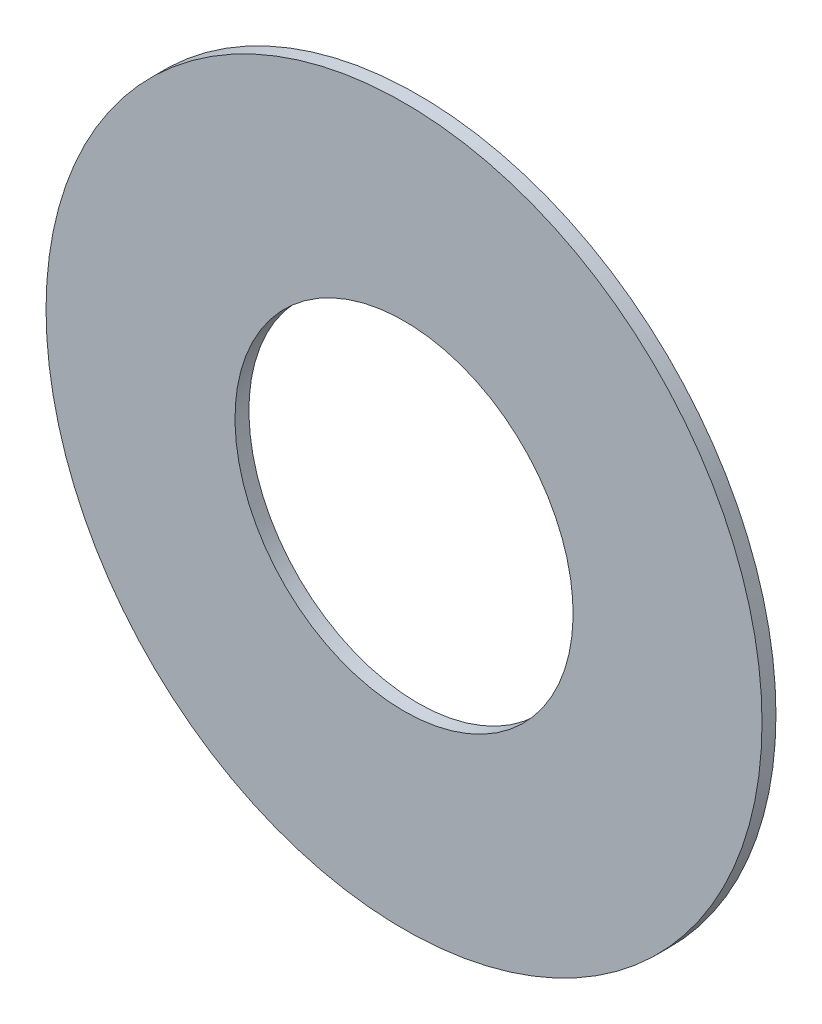
ISO-10303-21;
HEADER;
FILE_DESCRIPTION(('STEP AP214'),'2;1');
FILE_NAME('part.step','',(''),(''),'','','');
FILE_SCHEMA(('AUTOMOTIVE_DESIGN { 1 0 10303 214 1 1 1 1 }'));
ENDSEC;
DATA;
#1=APPLICATION_CONTEXT('core data for automotive mechanical design processes');
#2=APPLICATION_PROTOCOL_DEFINITION('international standard','automotive_design',2000,#1);
#3=PRODUCT_CONTEXT('',#1,'mechanical');
#4=PRODUCT('Part','Part','',(#3));
#5=PRODUCT_RELATED_PRODUCT_CATEGORY('part','',(#4));
#6=PRODUCT_DEFINITION_FORMATION('','',#4);
#7=PRODUCT_DEFINITION_CONTEXT('part definition',#1,'design');
#8=PRODUCT_DEFINITION('design','',#6,#7);
#9=PRODUCT_DEFINITION_SHAPE('','',#8);
#10=(LENGTH_UNIT() NAMED_UNIT(*) SI_UNIT(.MILLI.,.METRE.));
#11=(NAMED_UNIT(*) PLANE_ANGLE_UNIT() SI_UNIT($,.RADIAN.));
#12=(NAMED_UNIT(*) SI_UNIT($,.STERADIAN.) SOLID_ANGLE_UNIT());
#13=UNCERTAINTY_MEASURE_WITH_UNIT(LENGTH_MEASURE(1.E-05),#10,'distance_accuracy_value','');
#14=(GEOMETRIC_REPRESENTATION_CONTEXT(3) GLOBAL_UNCERTAINTY_ASSIGNED_CONTEXT((#13)) GLOBAL_UNIT_ASSIGNED_CONTEXT((#10,
#11,#12)) REPRESENTATION_CONTEXT('',''));
#15=CARTESIAN_POINT('',(0.,0.,0.));
#16=DIRECTION('',(0.,0.,1.));
#17=DIRECTION('',(1.,0.,0.));
#18=AXIS2_PLACEMENT_3D('',#15,#16,#17);
#19=CARTESIAN_POINT('',(120.645,-153.249,-0.045));
#20=DIRECTION('',(0.,0.,-1.));
#21=DIRECTION('',(0.,-1.,0.));
#22=AXIS2_PLACEMENT_3D('',#19,#20,#21);
#23=CYLINDRICAL_SURFACE('',#22,0.425);
#24=CARTESIAN_POINT('',(120.645,-153.249,-0.035));
#25=DIRECTION('',(0.,0.,-1.));
#26=DIRECTION('',(0.,-1.,0.));
#27=AXIS2_PLACEMENT_3D('',#24,#25,#26);
#28=CIRCLE('',#27,0.425);
#29=CARTESIAN_POINT('',(120.645,-153.674,-0.035));
#30=VERTEX_POINT('',#29);
#31=EDGE_CURVE('E20',#30,#30,#28,.T.);
#32=ORIENTED_EDGE('',*,*,#31,.T.);
#33=DIRECTION('',(0.,0.,1.));
#34=VECTOR('',#33,1.);
#35=CARTESIAN_POINT('',(120.645,-153.674,-0.045));
#36=LINE('',#35,#34);
#37=CARTESIAN_POINT('',(120.645,-153.674,0.));
#38=VERTEX_POINT('',#37);
#39=EDGE_CURVE('E11',#30,#38,#36,.T.);
#40=ORIENTED_EDGE('',*,*,#39,.T.);
#41=CARTESIAN_POINT('',(120.645,-153.249,0.));
#42=DIRECTION('',(0.,0.,-1.));
#43=DIRECTION('',(0.,-1.,0.));
#44=AXIS2_PLACEMENT_3D('',#41,#42,#43);
#45=CIRCLE('',#44,0.425);
#46=EDGE_CURVE('E68',#38,#38,#45,.T.);
#47=ORIENTED_EDGE('',*,*,#46,.F.);
#48=ORIENTED_EDGE('',*,*,#39,.F.);
#49=EDGE_LOOP('',(#32,#40,#47,#48));
#50=FACE_BOUND('',#49,.T.);
#51=ADVANCED_FACE('F17',(#50),#23,.F.);
#52=CARTESIAN_POINT('',(120.645,-153.249,-0.035));
#53=DIRECTION('',(0.,0.,1.));
#54=DIRECTION('',(1.,0.,0.));
#55=AXIS2_PLACEMENT_3D('',#52,#53,#54);
#56=PLANE('',#55);
#57=ORIENTED_EDGE('',*,*,#31,.F.);
#58=EDGE_LOOP('',(#57));
#59=FACE_BOUND('',#58,.T.);
#60=CARTESIAN_POINT('',(120.645,-153.249,-0.035));
#61=DIRECTION('',(0.,0.,1.));
#62=DIRECTION('',(1.,0.,0.));
#63=AXIS2_PLACEMENT_3D('',#60,#61,#62);
#64=CIRCLE('',#63,0.9);
#65=CARTESIAN_POINT('',(121.545,-153.249,-0.035));
#66=VERTEX_POINT('',#65);
#67=EDGE_CURVE('E56',#66,#66,#64,.T.);
#68=ORIENTED_EDGE('',*,*,#67,.F.);
#69=EDGE_LOOP('',(#68));
#70=FACE_BOUND('',#69,.T.);
#71=ADVANCED_FACE('F79',(#59,#70),#56,.F.);
#72=CARTESIAN_POINT('',(120.645,-153.249,0.));
#73=DIRECTION('',(0.,0.,1.));
#74=DIRECTION('',(1.,0.,0.));
#75=AXIS2_PLACEMENT_3D('',#72,#73,#74);
#76=PLANE('',#75);
#77=ORIENTED_EDGE('',*,*,#46,.T.);
#78=EDGE_LOOP('',(#77));
#79=FACE_BOUND('',#78,.T.);
#80=CARTESIAN_POINT('',(120.645,-153.249,0.));
#81=DIRECTION('',(0.,0.,1.));
#82=DIRECTION('',(1.,0.,0.));
#83=AXIS2_PLACEMENT_3D('',#80,#81,#82);
#84=CIRCLE('',#83,0.9);
#85=CARTESIAN_POINT('',(121.545,-153.249,0.));
#86=VERTEX_POINT('',#85);
#87=EDGE_CURVE('E54',#86,#86,#84,.T.);
#88=ORIENTED_EDGE('',*,*,#87,.T.);
#89=EDGE_LOOP('',(#88));
#90=FACE_BOUND('',#89,.T.);
#91=ADVANCED_FACE('F60',(#79,#90),#76,.T.);
#92=CARTESIAN_POINT('',(120.645,-153.249,-0.035));
#93=DIRECTION('',(0.,0.,1.));
#94=DIRECTION('',(1.,0.,0.));
#95=AXIS2_PLACEMENT_3D('',#92,#93,#94);
#96=CYLINDRICAL_SURFACE('',#95,0.9);
#97=ORIENTED_EDGE('',*,*,#87,.F.);
#98=DIRECTION('',(0.,0.,1.));
#99=VECTOR('',#98,1.);
#100=CARTESIAN_POINT('',(121.545,-153.249,-0.035));
#101=LINE('',#100,#99);
#102=EDGE_CURVE('E51',#66,#86,#101,.T.);
#103=ORIENTED_EDGE('',*,*,#102,.F.);
#104=ORIENTED_EDGE('',*,*,#67,.T.);
#105=ORIENTED_EDGE('',*,*,#102,.T.);
#106=EDGE_LOOP('',(#97,#103,#104,#105));
#107=FACE_BOUND('',#106,.T.);
#108=ADVANCED_FACE('F53',(#107),#96,.T.);
#109=CLOSED_SHELL('',(#51,#71,#91,#108));
#110=MANIFOLD_SOLID_BREP('B1',#109);
#111=ADVANCED_BREP_SHAPE_REPRESENTATION('',(#18,#110),#14);
#112=SHAPE_DEFINITION_REPRESENTATION(#9,#111);
ENDSEC;
END-ISO-10303-21;
